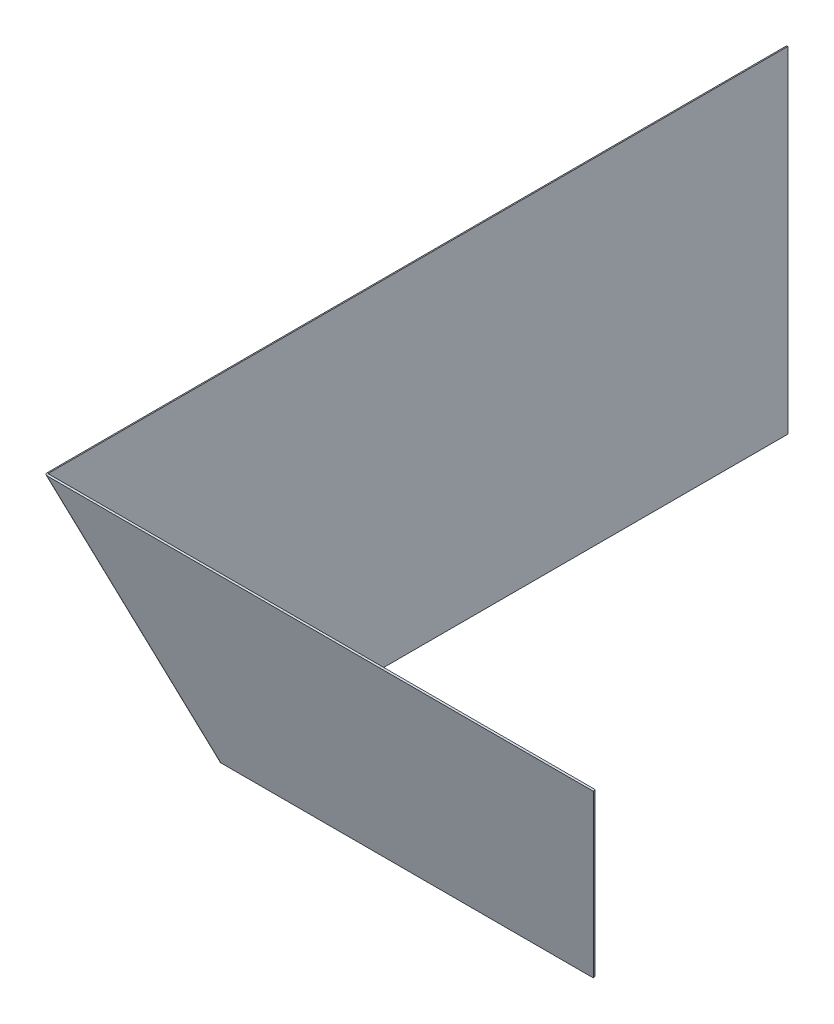
ISO-10303-21;
HEADER;
FILE_DESCRIPTION(('STEP AP214'),'2;1');
FILE_NAME('part.step','',(''),(''),'','','');
FILE_SCHEMA(('AUTOMOTIVE_DESIGN { 1 0 10303 214 1 1 1 1 }'));
ENDSEC;
DATA;
#1=APPLICATION_CONTEXT('core data for automotive mechanical design processes');
#2=APPLICATION_PROTOCOL_DEFINITION('international standard','automotive_design',2000,#1);
#3=PRODUCT_CONTEXT('',#1,'mechanical');
#4=PRODUCT('Part','Part','',(#3));
#5=PRODUCT_RELATED_PRODUCT_CATEGORY('part','',(#4));
#6=PRODUCT_DEFINITION_FORMATION('','',#4);
#7=PRODUCT_DEFINITION_CONTEXT('part definition',#1,'design');
#8=PRODUCT_DEFINITION('design','',#6,#7);
#9=PRODUCT_DEFINITION_SHAPE('','',#8);
#10=(LENGTH_UNIT() NAMED_UNIT(*) SI_UNIT(.MILLI.,.METRE.));
#11=(NAMED_UNIT(*) PLANE_ANGLE_UNIT() SI_UNIT($,.RADIAN.));
#12=(NAMED_UNIT(*) SI_UNIT($,.STERADIAN.) SOLID_ANGLE_UNIT());
#13=UNCERTAINTY_MEASURE_WITH_UNIT(LENGTH_MEASURE(1.E-05),#10,'distance_accuracy_value','');
#14=(GEOMETRIC_REPRESENTATION_CONTEXT(3) GLOBAL_UNCERTAINTY_ASSIGNED_CONTEXT((#13)) GLOBAL_UNIT_ASSIGNED_CONTEXT((#10,
#11,#12)) REPRESENTATION_CONTEXT('',''));
#15=CARTESIAN_POINT('',(0.,0.,0.));
#16=DIRECTION('',(0.,0.,1.));
#17=DIRECTION('',(1.,0.,0.));
#18=AXIS2_PLACEMENT_3D('',#15,#16,#17);
#19=CARTESIAN_POINT('',(-70.,200.,70.));
#20=DIRECTION('',(-0.330350424728106,0.943858356366017,0.));
#21=DIRECTION('',(0.,0.,-1.));
#22=AXIS2_PLACEMENT_3D('',#19,#20,#21);
#23=PLANE('',#22);
#24=DIRECTION('',(-0.943858356366017,-0.330350424728106,0.));
#25=VECTOR('',#24,1.);
#26=CARTESIAN_POINT('',(-70.,200.,69.3047539347008));
#27=LINE('',#26,#25);
#28=CARTESIAN_POINT('',(-70.,200.,69.3047539347008));
#29=VERTEX_POINT('',#28);
#30=CARTESIAN_POINT('',(-71.415787534549,199.504474362908,69.3047539347008));
#31=VERTEX_POINT('',#30);
#32=EDGE_CURVE('E11',#29,#31,#27,.T.);
#33=ORIENTED_EDGE('',*,*,#32,.F.);
#34=DIRECTION('',(0.,0.,-1.));
#35=VECTOR('',#34,1.);
#36=CARTESIAN_POINT('',(-70.,200.,70.));
#37=LINE('',#36,#35);
#38=CARTESIAN_POINT('',(-70.,200.,-525.));
#39=VERTEX_POINT('',#38);
#40=EDGE_CURVE('E156',#29,#39,#37,.T.);
#41=ORIENTED_EDGE('',*,*,#40,.T.);
#42=DIRECTION('',(-0.943858356366017,-0.330350424728106,0.));
#43=VECTOR('',#42,1.);
#44=CARTESIAN_POINT('',(-70.,200.,-525.));
#45=LINE('',#44,#43);
#46=CARTESIAN_POINT('',(-71.4157875345491,199.504474362908,-525.));
#47=VERTEX_POINT('',#46);
#48=EDGE_CURVE('E48',#39,#47,#45,.T.);
#49=ORIENTED_EDGE('',*,*,#48,.T.);
#50=DIRECTION('',(0.,0.,1.));
#51=VECTOR('',#50,1.);
#52=CARTESIAN_POINT('',(-71.415787534549,199.504474362908,0.));
#53=LINE('',#52,#51);
#54=EDGE_CURVE('E153',#31,#47,#53,.F.);
#55=ORIENTED_EDGE('',*,*,#54,.F.);
#56=EDGE_LOOP('',(#33,#41,#49,#55));
#57=FACE_BOUND('',#56,.T.);
#58=ADVANCED_FACE('F36',(#57),#23,.T.);
#59=CARTESIAN_POINT('',(0.,0.,-455.));
#60=DIRECTION('',(-0.103623495505852,0.29606713001672,0.949529581267909));
#61=DIRECTION('',(-0.313677500463755,0.896221429896442,-0.313677500463755));
#62=AXIS2_PLACEMENT_3D('',#59,#60,#61);
#63=PLANE('',#62);
#64=ORIENTED_EDGE('',*,*,#48,.F.);
#65=DIRECTION('',(-0.313677500463755,0.896221429896442,-0.313677500463755));
#66=VECTOR('',#65,1.);
#67=CARTESIAN_POINT('',(0.,0.,-455.));
#68=LINE('',#67,#66);
#69=CARTESIAN_POINT('',(0.,0.,-455.));
#70=VERTEX_POINT('',#69);
#71=EDGE_CURVE('E138',#70,#39,#68,.T.);
#72=ORIENTED_EDGE('',*,*,#71,.F.);
#73=DIRECTION('',(-0.943858356366017,-0.330350424728106,0.));
#74=VECTOR('',#73,1.);
#75=CARTESIAN_POINT('',(0.,0.,-455.));
#76=LINE('',#75,#74);
#77=CARTESIAN_POINT('',(-1.41578753454905,-0.495525637092159,-455.));
#78=VERTEX_POINT('',#77);
#79=EDGE_CURVE('E147',#70,#78,#76,.T.);
#80=ORIENTED_EDGE('',*,*,#79,.T.);
#81=DIRECTION('',(-0.313677500463755,0.896221429896442,-0.313677500463755));
#82=VECTOR('',#81,1.);
#83=CARTESIAN_POINT('',(-1.41578753454905,-0.495525637092159,-455.));
#84=LINE('',#83,#82);
#85=EDGE_CURVE('E165',#78,#47,#84,.T.);
#86=ORIENTED_EDGE('',*,*,#85,.T.);
#87=EDGE_LOOP('',(#64,#72,#80,#86));
#88=FACE_BOUND('',#87,.T.);
#89=ADVANCED_FACE('F171',(#88),#63,.F.);
#90=CARTESIAN_POINT('',(0.,0.,-455.));
#91=DIRECTION('',(0.330350424728106,-0.943858356366018,0.));
#92=DIRECTION('',(0.,0.,1.));
#93=AXIS2_PLACEMENT_3D('',#90,#91,#92);
#94=PLANE('',#93);
#95=ORIENTED_EDGE('',*,*,#79,.F.);
#96=DIRECTION('',(0.,0.,1.));
#97=VECTOR('',#96,1.);
#98=CARTESIAN_POINT('',(0.,0.,-455.));
#99=LINE('',#98,#97);
#100=CARTESIAN_POINT('',(0.,0.,-0.695246065299304));
#101=VERTEX_POINT('',#100);
#102=EDGE_CURVE('E136',#70,#101,#99,.T.);
#103=ORIENTED_EDGE('',*,*,#102,.T.);
#104=DIRECTION('',(-0.94385835636603,-0.33035042472807,-1.17016118263097E-13));
#105=VECTOR('',#104,1.);
#106=CARTESIAN_POINT('',(0.,0.,-0.695246065299304));
#107=LINE('',#106,#105);
#108=CARTESIAN_POINT('',(-1.41578753454903,-0.495525637092159,-0.695246065299304));
#109=VERTEX_POINT('',#108);
#110=EDGE_CURVE('E110',#101,#109,#107,.T.);
#111=ORIENTED_EDGE('',*,*,#110,.T.);
#112=DIRECTION('',(0.,0.,1.));
#113=VECTOR('',#112,1.);
#114=CARTESIAN_POINT('',(-1.41578753454903,-0.495525637092151,0.));
#115=LINE('',#114,#113);
#116=EDGE_CURVE('E172',#78,#109,#115,.T.);
#117=ORIENTED_EDGE('',*,*,#116,.F.);
#118=EDGE_LOOP('',(#95,#103,#111,#117));
#119=FACE_BOUND('',#118,.T.);
#120=ADVANCED_FACE('F219',(#119),#94,.T.);
#121=CARTESIAN_POINT('',(-0.751340264744087,-0.665410463050702,0.751340264744086));
#122=CARTESIAN_POINT('',(-0.434478139481848,-0.443606975367135,0.434478139481847));
#123=CARTESIAN_POINT('',(-0.117616014219609,-0.221803487683567,0.117616014219609));
#124=CARTESIAN_POINT('',(0.19924611104263,0.,-0.19924611104263));
#125=CARTESIAN_POINT('',(2.41168978885958,-0.665410463050702,3.91437031834775));
#126=CARTESIAN_POINT('',(2.02144513293527,-0.443606975367135,2.89040141189897));
#127=CARTESIAN_POINT('',(1.63120047701096,-0.221803487683567,1.86643250545018));
#128=CARTESIAN_POINT('',(1.24095582108665,0.,0.842463599001392));
#129=CARTESIAN_POINT('',(5.47519773494447,0.665410463050702,0.850862372262855));
#130=CARTESIAN_POINT('',(4.45122882849569,0.443606975367135,0.460617716338546));
#131=CARTESIAN_POINT('',(3.4272599220469,0.221803487683567,0.0703730604142373));
#132=CARTESIAN_POINT('',(2.40329101559811,0.,-0.319871595510071));
#133=CARTESIAN_POINT('',(2.31216768134081,0.665410463050702,-2.31216768134081));
#134=CARTESIAN_POINT('',(1.99530555607857,0.443606975367134,-1.99530555607857));
#135=CARTESIAN_POINT('',(1.67844343081633,0.221803487683567,-1.67844343081633));
#136=CARTESIAN_POINT('',(1.36158130555409,0.,-1.36158130555409));
#137=CARTESIAN_POINT('',(-0.850862372262854,0.665410463050702,-5.47519773494447));
#138=CARTESIAN_POINT('',(-0.460617716338546,0.443606975367134,-4.45122882849569));
#139=CARTESIAN_POINT('',(-0.0703730604142373,0.221803487683567,-3.4272599220469));
#140=CARTESIAN_POINT('',(0.319871595510071,0.,-2.40329101559812));
#141=CARTESIAN_POINT('',(-3.91437031834775,-0.665410463050702,-2.41168978885958));
#142=CARTESIAN_POINT('',(-2.89040141189897,-0.443606975367135,-2.02144513293527));
#143=CARTESIAN_POINT('',(-1.86643250545018,-0.221803487683567,-1.63120047701096));
#144=CARTESIAN_POINT('',(-0.842463599001392,0.,-1.24095582108665));
#145=CARTESIAN_POINT('',(-0.751340264744087,-0.665410463050702,0.751340264744086));
#146=CARTESIAN_POINT('',(-0.434478139481848,-0.443606975367135,0.434478139481847));
#147=CARTESIAN_POINT('',(-0.117616014219609,-0.221803487683567,0.117616014219609));
#148=CARTESIAN_POINT('',(0.19924611104263,0.,-0.19924611104263));
#149=(BOUNDED_SURFACE() B_SPLINE_SURFACE(3,3,((#121,#122,#123,#124),(#125,#126,#127,#128),(#129,
#130,#131,#132),(#133,#134,#135,#136),(#137,#138,#139,#140),(#141,#142,#143,#144),(#145,#146,
#147,#148)),.UNSPECIFIED.,.T.,.F.,.F.) B_SPLINE_SURFACE_WITH_KNOTS((4,3,4),(4,4),(0.,0.5,1.),
(0.,1.),.UNSPECIFIED.) GEOMETRIC_REPRESENTATION_ITEM() RATIONAL_B_SPLINE_SURFACE(((1.,1.,1.,1.),
(0.333333333333333,0.333333333333333,0.333333333333333,0.333333333333333),(0.333333333333333,
0.333333333333333,0.333333333333333,0.333333333333333),(1.,1.,1.,1.),(0.333333333333333,
0.333333333333333,0.333333333333333,0.333333333333333),(0.333333333333333,0.333333333333333,
0.333333333333333,0.333333333333333),(1.,1.,1.,1.))) REPRESENTATION_ITEM('') SURFACE());
#150=CARTESIAN_POINT('',(0.780413708298361,0.,-0.780413708298362));
#151=DIRECTION('',(0.,-1.,0.));
#152=DIRECTION('',(-0.707106781186548,0.,0.707106781186547));
#153=AXIS2_PLACEMENT_3D('',#150,#151,#152);
#154=ELLIPSE('',#153,0.82189509805084,0.7366);
#155=CARTESIAN_POINT('',(0.695246065299209,0.,0.));
#156=VERTEX_POINT('',#155);
#157=EDGE_CURVE('E119',#101,#156,#154,.F.);
#158=DIRECTION('',(0.,-0.330350424728106,0.943858356366018));
#159=VECTOR('',#158,1.);
#160=CARTESIAN_POINT('',(0.695246065299209,0.,0.));
#161=LINE('',#160,#159);
#162=CARTESIAN_POINT('',(0.695246065299209,-0.495525637092159,1.41578753454903));
#163=VERTEX_POINT('',#162);
#164=EDGE_CURVE('E56',#156,#163,#161,.T.);
#165=CARTESIAN_POINT('',(0.780413708298361,0.,-0.780413708298362));
#166=DIRECTION('',(0.207630538010989,-0.955917945940202,-0.207630538010988));
#167=DIRECTION('',(-0.675936061832233,-0.293633922817962,0.675936061832232));
#168=AXIS2_PLACEMENT_3D('',#165,#166,#167);
#169=ELLIPSE('',#168,2.26612258101807,2.2366);
#170=EDGE_CURVE('E174',#109,#163,#169,.F.);
#171=ORIENTED_EDGE('',*,*,#110,.F.);
#172=ORIENTED_EDGE('',*,*,#157,.T.);
#173=ORIENTED_EDGE('',*,*,#164,.T.);
#174=ORIENTED_EDGE('',*,*,#170,.F.);
#175=EDGE_LOOP('',(#171,#172,#173,#174));
#176=FACE_BOUND('',#175,.T.);
#177=ADVANCED_FACE('F134',(#176),#149,.F.);
#178=CARTESIAN_POINT('',(0.,0.,0.));
#179=DIRECTION('',(0.,-0.943858356366018,-0.330350424728106));
#180=DIRECTION('',(1.,0.,0.));
#181=AXIS2_PLACEMENT_3D('',#178,#179,#180);
#182=PLANE('',#181);
#183=ORIENTED_EDGE('',*,*,#164,.F.);
#184=DIRECTION('',(1.,0.,0.));
#185=VECTOR('',#184,1.);
#186=CARTESIAN_POINT('',(0.,0.,0.));
#187=LINE('',#186,#185);
#188=CARTESIAN_POINT('',(300.,0.,0.));
#189=VERTEX_POINT('',#188);
#190=EDGE_CURVE('E106',#156,#189,#187,.T.);
#191=ORIENTED_EDGE('',*,*,#190,.T.);
#192=DIRECTION('',(0.,-0.330350424728106,0.943858356366018));
#193=VECTOR('',#192,1.);
#194=CARTESIAN_POINT('',(300.,0.,0.));
#195=LINE('',#194,#193);
#196=CARTESIAN_POINT('',(300.,-0.495525637092159,1.41578753454903));
#197=VERTEX_POINT('',#196);
#198=EDGE_CURVE('E111',#189,#197,#195,.T.);
#199=ORIENTED_EDGE('',*,*,#198,.T.);
#200=DIRECTION('',(1.,0.,0.));
#201=VECTOR('',#200,1.);
#202=CARTESIAN_POINT('',(0.,-0.495525637092159,1.41578753454903));
#203=LINE('',#202,#201);
#204=EDGE_CURVE('E108',#163,#197,#203,.T.);
#205=ORIENTED_EDGE('',*,*,#204,.F.);
#206=EDGE_LOOP('',(#183,#191,#199,#205));
#207=FACE_BOUND('',#206,.T.);
#208=ADVANCED_FACE('F103',(#207),#182,.T.);
#209=CARTESIAN_POINT('',(370.,200.,70.));
#210=DIRECTION('',(-0.949529581267909,0.29606713001672,0.103623495505852));
#211=DIRECTION('',(-0.313677500463755,-0.896221429896442,-0.313677500463754));
#212=AXIS2_PLACEMENT_3D('',#209,#210,#211);
#213=PLANE('',#212);
#214=ORIENTED_EDGE('',*,*,#198,.F.);
#215=DIRECTION('',(-0.313677500463755,-0.896221429896442,-0.313677500463754));
#216=VECTOR('',#215,1.);
#217=CARTESIAN_POINT('',(370.,200.,70.));
#218=LINE('',#217,#216);
#219=CARTESIAN_POINT('',(370.,200.,70.));
#220=VERTEX_POINT('',#219);
#221=EDGE_CURVE('E131',#220,#189,#218,.T.);
#222=ORIENTED_EDGE('',*,*,#221,.F.);
#223=DIRECTION('',(0.,-0.330350424728106,0.943858356366018));
#224=VECTOR('',#223,1.);
#225=CARTESIAN_POINT('',(370.,200.,70.));
#226=LINE('',#225,#224);
#227=CARTESIAN_POINT('',(370.,199.504474362908,71.415787534549));
#228=VERTEX_POINT('',#227);
#229=EDGE_CURVE('E142',#220,#228,#226,.T.);
#230=ORIENTED_EDGE('',*,*,#229,.T.);
#231=DIRECTION('',(-0.313677500463755,-0.896221429896442,-0.313677500463754));
#232=VECTOR('',#231,1.);
#233=CARTESIAN_POINT('',(370.,199.504474362908,71.415787534549));
#234=LINE('',#233,#232);
#235=EDGE_CURVE('E169',#228,#197,#234,.T.);
#236=ORIENTED_EDGE('',*,*,#235,.T.);
#237=EDGE_LOOP('',(#214,#222,#230,#236));
#238=FACE_BOUND('',#237,.T.);
#239=ADVANCED_FACE('F204',(#238),#213,.F.);
#240=CARTESIAN_POINT('',(370.,200.,70.));
#241=DIRECTION('',(0.,0.943858356366018,0.330350424728106));
#242=DIRECTION('',(-1.,0.,0.));
#243=AXIS2_PLACEMENT_3D('',#240,#241,#242);
#244=PLANE('',#243);
#245=ORIENTED_EDGE('',*,*,#229,.F.);
#246=DIRECTION('',(-1.,0.,0.));
#247=VECTOR('',#246,1.);
#248=CARTESIAN_POINT('',(370.,200.,70.));
#249=LINE('',#248,#247);
#250=CARTESIAN_POINT('',(-69.3047539347008,200.,70.));
#251=VERTEX_POINT('',#250);
#252=EDGE_CURVE('E132',#220,#251,#249,.T.);
#253=ORIENTED_EDGE('',*,*,#252,.T.);
#254=DIRECTION('',(0.,-0.330350424728112,0.943858356366015));
#255=VECTOR('',#254,1.);
#256=CARTESIAN_POINT('',(-69.3047539347008,200.,70.));
#257=LINE('',#256,#255);
#258=CARTESIAN_POINT('',(-69.3047539347008,199.504474362908,71.415787534549));
#259=VERTEX_POINT('',#258);
#260=EDGE_CURVE('E42',#251,#259,#257,.T.);
#261=ORIENTED_EDGE('',*,*,#260,.T.);
#262=DIRECTION('',(1.,0.,0.));
#263=VECTOR('',#262,1.);
#264=CARTESIAN_POINT('',(0.,199.504474362908,71.415787534549));
#265=LINE('',#264,#263);
#266=EDGE_CURVE('E194',#228,#259,#265,.F.);
#267=ORIENTED_EDGE('',*,*,#266,.F.);
#268=EDGE_LOOP('',(#245,#253,#261,#267));
#269=FACE_BOUND('',#268,.T.);
#270=ADVANCED_FACE('F206',(#269),#244,.T.);
#271=CARTESIAN_POINT('',(-70.7513402647441,199.334589536949,70.7513402647441));
#272=CARTESIAN_POINT('',(-70.4344781394818,199.556393024633,70.4344781394818));
#273=CARTESIAN_POINT('',(-70.1176160142196,199.778196512316,70.1176160142196));
#274=CARTESIAN_POINT('',(-69.8007538889574,200.,69.8007538889573));
#275=CARTESIAN_POINT('',(-73.9143703183477,199.334589536949,67.5883102111404));
#276=CARTESIAN_POINT('',(-72.890401411899,199.556393024633,67.9785548670647));
#277=CARTESIAN_POINT('',(-71.8664325054502,199.778196512316,68.368799522989));
#278=CARTESIAN_POINT('',(-70.8424635990014,200.,68.7590441789133));
#279=CARTESIAN_POINT('',(-70.8508623722629,200.665410463051,64.5248022650555));
#280=CARTESIAN_POINT('',(-70.4606177163386,200.443606975367,65.5487711715043));
#281=CARTESIAN_POINT('',(-70.0703730604143,200.221803487684,66.5727400779531));
#282=CARTESIAN_POINT('',(-69.6801284044899,200.,67.5967089844019));
#283=CARTESIAN_POINT('',(-67.6878323186592,200.665410463051,67.6878323186592));
#284=CARTESIAN_POINT('',(-68.0046944439214,200.443606975367,68.0046944439214));
#285=CARTESIAN_POINT('',(-68.3215565691837,200.221803487684,68.3215565691837));
#286=CARTESIAN_POINT('',(-68.6384186944459,200.,68.6384186944459));
#287=CARTESIAN_POINT('',(-64.5248022650555,200.665410463051,70.8508623722629));
#288=CARTESIAN_POINT('',(-65.5487711715044,200.443606975367,70.4606177163385));
#289=CARTESIAN_POINT('',(-66.5727400779531,200.221803487684,70.0703730604143));
#290=CARTESIAN_POINT('',(-67.5967089844019,200.,69.6801284044899));
#291=CARTESIAN_POINT('',(-67.5883102111404,199.334589536949,73.9143703183477));
#292=CARTESIAN_POINT('',(-67.9785548670648,199.556393024633,72.8904014118989));
#293=CARTESIAN_POINT('',(-68.3687995229891,199.778196512316,71.8664325054502));
#294=CARTESIAN_POINT('',(-68.7590441789133,200.,70.8424635990014));
#295=CARTESIAN_POINT('',(-70.7513402647441,199.334589536949,70.7513402647441));
#296=CARTESIAN_POINT('',(-70.4344781394818,199.556393024633,70.4344781394818));
#297=CARTESIAN_POINT('',(-70.1176160142196,199.778196512316,70.1176160142196));
#298=CARTESIAN_POINT('',(-69.8007538889574,200.,69.8007538889573));
#299=(BOUNDED_SURFACE() B_SPLINE_SURFACE(3,3,((#271,#272,#273,#274),(#275,#276,#277,#278),(#279,
#280,#281,#282),(#283,#284,#285,#286),(#287,#288,#289,#290),(#291,#292,#293,#294),(#295,#296,
#297,#298)),.UNSPECIFIED.,.T.,.F.,.F.) B_SPLINE_SURFACE_WITH_KNOTS((4,3,4),(4,4),(0.,0.5,1.),
(0.,1.),.UNSPECIFIED.) GEOMETRIC_REPRESENTATION_ITEM() RATIONAL_B_SPLINE_SURFACE(((1.,1.,1.,1.),
(0.333333333333333,0.333333333333333,0.333333333333333,0.333333333333333),(0.333333333333333,
0.333333333333333,0.333333333333333,0.333333333333333),(1.,1.,1.,1.),(0.333333333333333,
0.333333333333333,0.333333333333333,0.333333333333333),(0.333333333333333,0.333333333333333,
0.333333333333333,0.333333333333333),(1.,1.,1.,1.))) REPRESENTATION_ITEM('') SURFACE());
#300=CARTESIAN_POINT('',(-69.2195862917016,200.,69.2195862917016));
#301=DIRECTION('',(0.,1.,0.));
#302=DIRECTION('',(-0.707106781186548,0.,0.707106781186547));
#303=AXIS2_PLACEMENT_3D('',#300,#301,#302);
#304=ELLIPSE('',#303,0.82189509805084,0.7366);
#305=EDGE_CURVE('E121',#251,#29,#304,.F.);
#306=CARTESIAN_POINT('',(-69.2195862917016,200.,69.2195862917016));
#307=DIRECTION('',(-0.207630538010989,0.955917945940202,0.207630538010989));
#308=DIRECTION('',(-0.675936061832232,-0.293633922817963,0.675936061832232));
#309=AXIS2_PLACEMENT_3D('',#306,#307,#308);
#310=ELLIPSE('',#309,2.26612258101806,2.2366);
#311=EDGE_CURVE('E125',#259,#31,#310,.F.);
#312=ORIENTED_EDGE('',*,*,#305,.T.);
#313=ORIENTED_EDGE('',*,*,#32,.T.);
#314=ORIENTED_EDGE('',*,*,#311,.F.);
#315=ORIENTED_EDGE('',*,*,#260,.F.);
#316=EDGE_LOOP('',(#312,#313,#314,#315));
#317=FACE_BOUND('',#316,.T.);
#318=ADVANCED_FACE('F38',(#317),#299,.F.);
#319=CARTESIAN_POINT('',(0.,-0.495525637092159,1.41578753454903));
#320=DIRECTION('',(0.,-0.330350424728106,0.943858356366018));
#321=DIRECTION('',(0.,-0.943858356366018,-0.330350424728106));
#322=AXIS2_PLACEMENT_3D('',#319,#320,#321);
#323=PLANE('',#322);
#324=ORIENTED_EDGE('',*,*,#266,.T.);
#325=DIRECTION('',(-0.313677500463755,0.896221429896442,0.313677500463754));
#326=VECTOR('',#325,1.);
#327=CARTESIAN_POINT('',(0.62683831991835,-0.300074936004032,1.48419527992987));
#328=LINE('',#327,#326);
#329=EDGE_CURVE('E191',#259,#163,#328,.F.);
#330=ORIENTED_EDGE('',*,*,#329,.T.);
#331=ORIENTED_EDGE('',*,*,#204,.T.);
#332=ORIENTED_EDGE('',*,*,#235,.F.);
#333=EDGE_LOOP('',(#324,#330,#331,#332));
#334=FACE_BOUND('',#333,.T.);
#335=ADVANCED_FACE('F201',(#334),#323,.T.);
#336=CARTESIAN_POINT('',(-1.41578753454903,-0.495525637092159,0.));
#337=DIRECTION('',(-0.943858356366017,-0.330350424728106,0.));
#338=DIRECTION('',(0.330350424728106,-0.943858356366017,0.));
#339=AXIS2_PLACEMENT_3D('',#336,#337,#338);
#340=PLANE('',#339);
#341=ORIENTED_EDGE('',*,*,#116,.T.);
#342=DIRECTION('',(-0.313677500463755,0.896221429896442,0.313677500463754));
#343=VECTOR('',#342,1.);
#344=CARTESIAN_POINT('',(-1.48419527992987,-0.300074936004041,-0.626838319918323));
#345=LINE('',#344,#343);
#346=EDGE_CURVE('E168',#109,#31,#345,.T.);
#347=ORIENTED_EDGE('',*,*,#346,.T.);
#348=ORIENTED_EDGE('',*,*,#54,.T.);
#349=ORIENTED_EDGE('',*,*,#85,.F.);
#350=EDGE_LOOP('',(#341,#347,#348,#349));
#351=FACE_BOUND('',#350,.T.);
#352=ADVANCED_FACE('F164',(#351),#340,.T.);
#353=CARTESIAN_POINT('',(0.626838319918363,0.438786823942854,-0.626838319918363));
#354=DIRECTION('',(-0.313677500463755,0.896221429896442,0.313677500463754));
#355=DIRECTION('',(-0.943858356366017,-0.330350424728106,0.));
#356=AXIS2_PLACEMENT_3D('',#353,#354,#355);
#357=CYLINDRICAL_SURFACE('',#356,2.2366);
#358=ORIENTED_EDGE('',*,*,#170,.T.);
#359=ORIENTED_EDGE('',*,*,#329,.F.);
#360=ORIENTED_EDGE('',*,*,#311,.T.);
#361=ORIENTED_EDGE('',*,*,#346,.F.);
#362=EDGE_LOOP('',(#358,#359,#360,#361));
#363=FACE_BOUND('',#362,.T.);
#364=ADVANCED_FACE('F190',(#363),#357,.T.);
#365=CARTESIAN_POINT('',(0.,0.,0.));
#366=DIRECTION('',(0.,-0.330350424728106,0.943858356366018));
#367=DIRECTION('',(0.,-0.943858356366018,-0.330350424728106));
#368=AXIS2_PLACEMENT_3D('',#365,#366,#367);
#369=PLANE('',#368);
#370=ORIENTED_EDGE('',*,*,#252,.F.);
#371=ORIENTED_EDGE('',*,*,#221,.T.);
#372=ORIENTED_EDGE('',*,*,#190,.F.);
#373=DIRECTION('',(-0.313677500463755,0.896221429896442,0.313677500463755));
#374=VECTOR('',#373,1.);
#375=CARTESIAN_POINT('',(0.626838319918363,0.195450701088131,0.0684077453808458));
#376=LINE('',#375,#374);
#377=EDGE_CURVE('E116',#251,#156,#376,.F.);
#378=ORIENTED_EDGE('',*,*,#377,.F.);
#379=EDGE_LOOP('',(#370,#371,#372,#378));
#380=FACE_BOUND('',#379,.T.);
#381=ADVANCED_FACE('F129',(#380),#369,.F.);
#382=CARTESIAN_POINT('',(0.,0.,0.));
#383=DIRECTION('',(-0.943858356366017,-0.330350424728106,0.));
#384=DIRECTION('',(0.330350424728106,-0.943858356366017,0.));
#385=AXIS2_PLACEMENT_3D('',#382,#383,#384);
#386=PLANE('',#385);
#387=ORIENTED_EDGE('',*,*,#102,.F.);
#388=ORIENTED_EDGE('',*,*,#71,.T.);
#389=ORIENTED_EDGE('',*,*,#40,.F.);
#390=DIRECTION('',(-0.313677500463755,0.896221429896442,0.313677500463755));
#391=VECTOR('',#390,1.);
#392=CARTESIAN_POINT('',(-0.0684077453808459,0.195450701088131,-0.626838319918363));
#393=LINE('',#392,#391);
#394=EDGE_CURVE('E126',#101,#29,#393,.T.);
#395=ORIENTED_EDGE('',*,*,#394,.F.);
#396=EDGE_LOOP('',(#387,#388,#389,#395));
#397=FACE_BOUND('',#396,.T.);
#398=ADVANCED_FACE('F186',(#397),#386,.F.);
#399=CARTESIAN_POINT('',(0.626838319918363,0.438786823942854,-0.626838319918363));
#400=DIRECTION('',(-0.313677500463755,0.896221429896442,0.313677500463754));
#401=DIRECTION('',(-0.943858356366017,-0.330350424728106,0.));
#402=AXIS2_PLACEMENT_3D('',#399,#400,#401);
#403=CYLINDRICAL_SURFACE('',#402,0.7366);
#404=ORIENTED_EDGE('',*,*,#157,.F.);
#405=ORIENTED_EDGE('',*,*,#394,.T.);
#406=ORIENTED_EDGE('',*,*,#305,.F.);
#407=ORIENTED_EDGE('',*,*,#377,.T.);
#408=EDGE_LOOP('',(#404,#405,#406,#407));
#409=FACE_BOUND('',#408,.T.);
#410=ADVANCED_FACE('F117',(#409),#403,.F.);
#411=CLOSED_SHELL('',(#58,#89,#120,#177,#208,#239,#270,#318,#335,#352,#364,#381,#398,#410));
#412=MANIFOLD_SOLID_BREP('B2',#411);
#413=ADVANCED_BREP_SHAPE_REPRESENTATION('',(#18,#412),#14);
#414=SHAPE_DEFINITION_REPRESENTATION(#9,#413);
ENDSEC;
END-ISO-10303-21;
